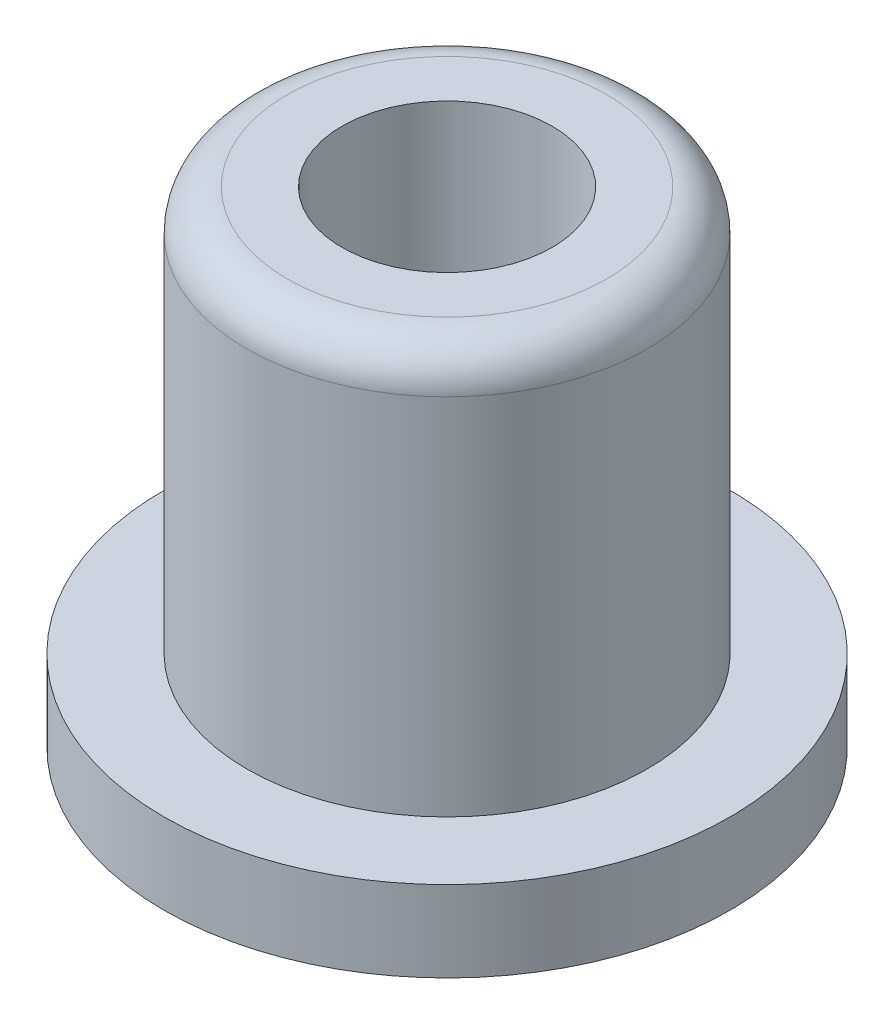
ISO-10303-21;
HEADER;
FILE_DESCRIPTION(('STEP AP214'),'2;1');
FILE_NAME('part.step','',(''),(''),'','','');
FILE_SCHEMA(('AUTOMOTIVE_DESIGN { 1 0 10303 214 1 1 1 1 }'));
ENDSEC;
DATA;
#1=APPLICATION_CONTEXT('core data for automotive mechanical design processes');
#2=APPLICATION_PROTOCOL_DEFINITION('international standard','automotive_design',2000,#1);
#3=PRODUCT_CONTEXT('',#1,'mechanical');
#4=PRODUCT('Part','Part','',(#3));
#5=PRODUCT_RELATED_PRODUCT_CATEGORY('part','',(#4));
#6=PRODUCT_DEFINITION_FORMATION('','',#4);
#7=PRODUCT_DEFINITION_CONTEXT('part definition',#1,'design');
#8=PRODUCT_DEFINITION('design','',#6,#7);
#9=PRODUCT_DEFINITION_SHAPE('','',#8);
#10=(LENGTH_UNIT() NAMED_UNIT(*) SI_UNIT(.MILLI.,.METRE.));
#11=(NAMED_UNIT(*) PLANE_ANGLE_UNIT() SI_UNIT($,.RADIAN.));
#12=(NAMED_UNIT(*) SI_UNIT($,.STERADIAN.) SOLID_ANGLE_UNIT());
#13=UNCERTAINTY_MEASURE_WITH_UNIT(LENGTH_MEASURE(1.E-05),#10,'distance_accuracy_value','');
#14=(GEOMETRIC_REPRESENTATION_CONTEXT(3) GLOBAL_UNCERTAINTY_ASSIGNED_CONTEXT((#13)) GLOBAL_UNIT_ASSIGNED_CONTEXT((#10,
#11,#12)) REPRESENTATION_CONTEXT('',''));
#15=CARTESIAN_POINT('',(0.,0.,0.));
#16=DIRECTION('',(0.,0.,1.));
#17=DIRECTION('',(1.,0.,0.));
#18=AXIS2_PLACEMENT_3D('',#15,#16,#17);
#19=CARTESIAN_POINT('',(0.,2.,0.));
#20=DIRECTION('',(0.,-1.,0.));
#21=DIRECTION('',(0.,0.,-1.));
#22=AXIS2_PLACEMENT_3D('',#19,#20,#21);
#23=CYLINDRICAL_SURFACE('',#22,7.);
#24=CARTESIAN_POINT('',(0.,2.,0.));
#25=DIRECTION('',(0.,1.,0.));
#26=DIRECTION('',(0.,0.,1.));
#27=AXIS2_PLACEMENT_3D('',#24,#25,#26);
#28=CIRCLE('',#27,7.);
#29=CARTESIAN_POINT('',(0.,2.,7.));
#30=VERTEX_POINT('',#29);
#31=EDGE_CURVE('E53',#30,#30,#28,.T.);
#32=ORIENTED_EDGE('',*,*,#31,.F.);
#33=EDGE_LOOP('',(#32));
#34=FACE_BOUND('',#33,.T.);
#35=CARTESIAN_POINT('',(0.,0.,0.));
#36=DIRECTION('',(0.,1.,0.));
#37=DIRECTION('',(0.,0.,1.));
#38=AXIS2_PLACEMENT_3D('',#35,#36,#37);
#39=CIRCLE('',#38,7.);
#40=CARTESIAN_POINT('',(0.,0.,7.));
#41=VERTEX_POINT('',#40);
#42=EDGE_CURVE('E56',#41,#41,#39,.T.);
#43=ORIENTED_EDGE('',*,*,#42,.T.);
#44=EDGE_LOOP('',(#43));
#45=FACE_BOUND('',#44,.T.);
#46=ADVANCED_FACE('F38',(#34,#45),#23,.T.);
#47=CARTESIAN_POINT('',(0.,2.,0.));
#48=DIRECTION('',(0.,1.,0.));
#49=DIRECTION('',(0.,0.,1.));
#50=AXIS2_PLACEMENT_3D('',#47,#48,#49);
#51=PLANE('',#50);
#52=CARTESIAN_POINT('',(0.,2.,0.));
#53=DIRECTION('',(0.,1.,0.));
#54=DIRECTION('',(0.,0.,1.));
#55=AXIS2_PLACEMENT_3D('',#52,#53,#54);
#56=CIRCLE('',#55,4.95);
#57=CARTESIAN_POINT('',(0.,2.,4.95));
#58=VERTEX_POINT('',#57);
#59=EDGE_CURVE('E49',#58,#58,#56,.T.);
#60=ORIENTED_EDGE('',*,*,#59,.F.);
#61=EDGE_LOOP('',(#60));
#62=FACE_BOUND('',#61,.T.);
#63=ORIENTED_EDGE('',*,*,#31,.T.);
#64=EDGE_LOOP('',(#63));
#65=FACE_BOUND('',#64,.T.);
#66=ADVANCED_FACE('F80',(#62,#65),#51,.T.);
#67=CARTESIAN_POINT('',(0.,0.,0.));
#68=DIRECTION('',(0.,1.,0.));
#69=DIRECTION('',(0.,0.,1.));
#70=AXIS2_PLACEMENT_3D('',#67,#68,#69);
#71=PLANE('',#70);
#72=CARTESIAN_POINT('',(0.,0.,0.));
#73=DIRECTION('',(0.,-1.,0.));
#74=DIRECTION('',(0.,0.,-1.));
#75=AXIS2_PLACEMENT_3D('',#72,#73,#74);
#76=CIRCLE('',#75,2.6);
#77=CARTESIAN_POINT('',(0.,0.,-2.6));
#78=VERTEX_POINT('',#77);
#79=EDGE_CURVE('E62',#78,#78,#76,.T.);
#80=ORIENTED_EDGE('',*,*,#79,.F.);
#81=EDGE_LOOP('',(#80));
#82=FACE_BOUND('',#81,.T.);
#83=ORIENTED_EDGE('',*,*,#42,.F.);
#84=EDGE_LOOP('',(#83));
#85=FACE_BOUND('',#84,.T.);
#86=ADVANCED_FACE('F76',(#82,#85),#71,.F.);
#87=CARTESIAN_POINT('',(0.,12.,0.));
#88=DIRECTION('',(0.,-1.,0.));
#89=DIRECTION('',(0.,0.,-1.));
#90=AXIS2_PLACEMENT_3D('',#87,#88,#89);
#91=CYLINDRICAL_SURFACE('',#90,4.95);
#92=CARTESIAN_POINT('',(0.,11.,0.));
#93=DIRECTION('',(0.,1.,0.));
#94=DIRECTION('',(0.,0.,1.));
#95=AXIS2_PLACEMENT_3D('',#92,#93,#94);
#96=CIRCLE('',#95,4.95);
#97=CARTESIAN_POINT('',(0.,11.,4.95));
#98=VERTEX_POINT('',#97);
#99=EDGE_CURVE('E10',#98,#98,#96,.F.);
#100=ORIENTED_EDGE('',*,*,#99,.T.);
#101=EDGE_LOOP('',(#100));
#102=FACE_BOUND('',#101,.T.);
#103=ORIENTED_EDGE('',*,*,#59,.T.);
#104=EDGE_LOOP('',(#103));
#105=FACE_BOUND('',#104,.T.);
#106=ADVANCED_FACE('F79',(#102,#105),#91,.T.);
#107=CARTESIAN_POINT('',(0.,12.,0.));
#108=DIRECTION('',(0.,1.,0.));
#109=DIRECTION('',(0.,0.,1.));
#110=AXIS2_PLACEMENT_3D('',#107,#108,#109);
#111=PLANE('',#110);
#112=CARTESIAN_POINT('',(0.,12.,0.));
#113=DIRECTION('',(0.,1.,0.));
#114=DIRECTION('',(0.,0.,1.));
#115=AXIS2_PLACEMENT_3D('',#112,#113,#114);
#116=CIRCLE('',#115,3.95);
#117=CARTESIAN_POINT('',(0.,12.,3.95));
#118=VERTEX_POINT('',#117);
#119=EDGE_CURVE('E45',#118,#118,#116,.T.);
#120=ORIENTED_EDGE('',*,*,#119,.T.);
#121=EDGE_LOOP('',(#120));
#122=FACE_BOUND('',#121,.T.);
#123=CARTESIAN_POINT('',(0.,12.,0.));
#124=DIRECTION('',(0.,-1.,0.));
#125=DIRECTION('',(0.,0.,-1.));
#126=AXIS2_PLACEMENT_3D('',#123,#124,#125);
#127=CIRCLE('',#126,2.6);
#128=CARTESIAN_POINT('',(0.,12.,-2.6));
#129=VERTEX_POINT('',#128);
#130=EDGE_CURVE('E59',#129,#129,#127,.T.);
#131=ORIENTED_EDGE('',*,*,#130,.T.);
#132=EDGE_LOOP('',(#131));
#133=FACE_BOUND('',#132,.T.);
#134=ADVANCED_FACE('F68',(#122,#133),#111,.T.);
#135=CARTESIAN_POINT('',(0.,12.,0.));
#136=DIRECTION('',(0.,-1.,0.));
#137=DIRECTION('',(0.,0.,-1.));
#138=AXIS2_PLACEMENT_3D('',#135,#136,#137);
#139=CYLINDRICAL_SURFACE('',#138,2.6);
#140=ORIENTED_EDGE('',*,*,#130,.F.);
#141=EDGE_LOOP('',(#140));
#142=FACE_BOUND('',#141,.T.);
#143=ORIENTED_EDGE('',*,*,#79,.T.);
#144=EDGE_LOOP('',(#143));
#145=FACE_BOUND('',#144,.T.);
#146=ADVANCED_FACE('F70',(#142,#145),#139,.F.);
#147=CARTESIAN_POINT('',(0.,11.,0.));
#148=DIRECTION('',(0.,1.,0.));
#149=DIRECTION('',(0.,0.,1.));
#150=AXIS2_PLACEMENT_3D('',#147,#148,#149);
#151=TOROIDAL_SURFACE('',#150,3.95,1.);
#152=ORIENTED_EDGE('',*,*,#99,.F.);
#153=EDGE_LOOP('',(#152));
#154=FACE_BOUND('',#153,.T.);
#155=ORIENTED_EDGE('',*,*,#119,.F.);
#156=EDGE_LOOP('',(#155));
#157=FACE_BOUND('',#156,.T.);
#158=ADVANCED_FACE('F40',(#154,#157),#151,.T.);
#159=CLOSED_SHELL('',(#46,#66,#86,#106,#134,#146,#158));
#160=MANIFOLD_SOLID_BREP('B2',#159);
#161=ADVANCED_BREP_SHAPE_REPRESENTATION('',(#18,#160),#14);
#162=SHAPE_DEFINITION_REPRESENTATION(#9,#161);
ENDSEC;
END-ISO-10303-21;
